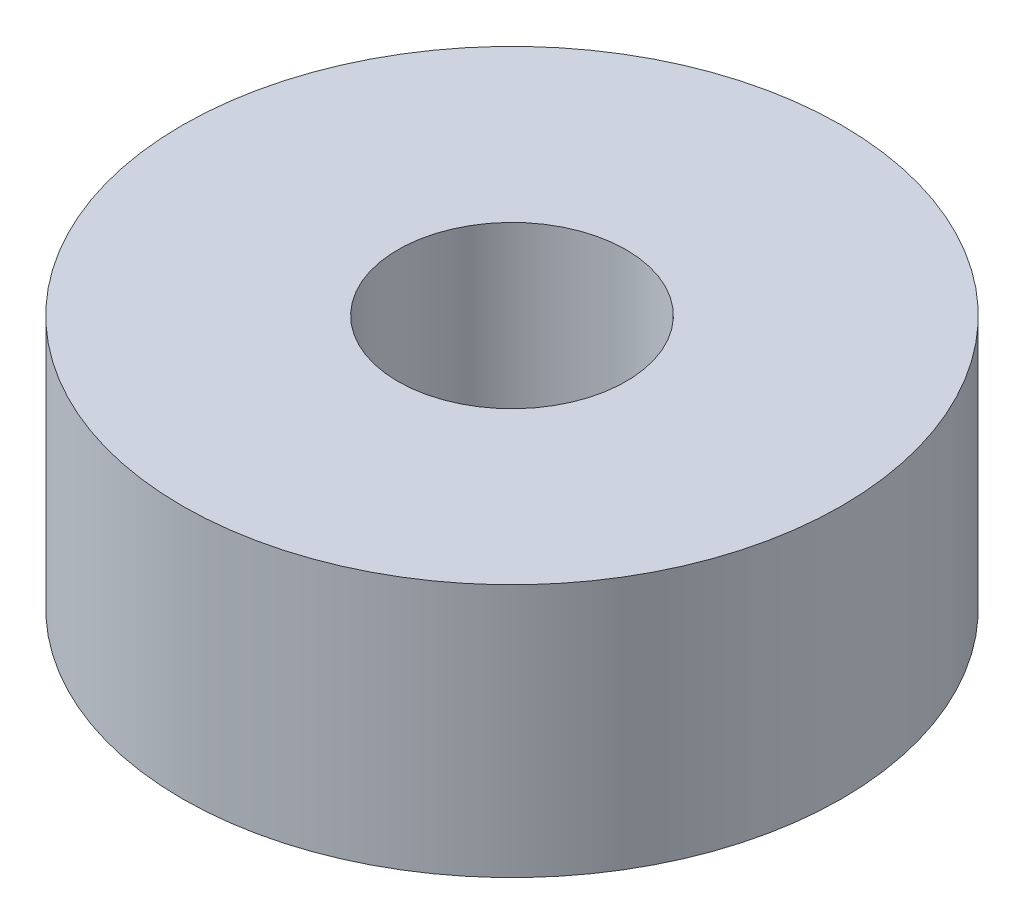
ISO-10303-21;
HEADER;
FILE_DESCRIPTION(('STEP AP214'),'2;1');
FILE_NAME('part.step','',(''),(''),'','','');
FILE_SCHEMA(('AUTOMOTIVE_DESIGN { 1 0 10303 214 1 1 1 1 }'));
ENDSEC;
DATA;
#1=APPLICATION_CONTEXT('core data for automotive mechanical design processes');
#2=APPLICATION_PROTOCOL_DEFINITION('international standard','automotive_design',2000,#1);
#3=PRODUCT_CONTEXT('',#1,'mechanical');
#4=PRODUCT('Part','Part','',(#3));
#5=PRODUCT_RELATED_PRODUCT_CATEGORY('part','',(#4));
#6=PRODUCT_DEFINITION_FORMATION('','',#4);
#7=PRODUCT_DEFINITION_CONTEXT('part definition',#1,'design');
#8=PRODUCT_DEFINITION('design','',#6,#7);
#9=PRODUCT_DEFINITION_SHAPE('','',#8);
#10=(LENGTH_UNIT() NAMED_UNIT(*) SI_UNIT(.MILLI.,.METRE.));
#11=(NAMED_UNIT(*) PLANE_ANGLE_UNIT() SI_UNIT($,.RADIAN.));
#12=(NAMED_UNIT(*) SI_UNIT($,.STERADIAN.) SOLID_ANGLE_UNIT());
#13=UNCERTAINTY_MEASURE_WITH_UNIT(LENGTH_MEASURE(1.E-05),#10,'distance_accuracy_value','');
#14=(GEOMETRIC_REPRESENTATION_CONTEXT(3) GLOBAL_UNCERTAINTY_ASSIGNED_CONTEXT((#13)) GLOBAL_UNIT_ASSIGNED_CONTEXT((#10,
#11,#12)) REPRESENTATION_CONTEXT('',''));
#15=CARTESIAN_POINT('',(0.,0.,0.));
#16=DIRECTION('',(0.,0.,1.));
#17=DIRECTION('',(1.,0.,0.));
#18=AXIS2_PLACEMENT_3D('',#15,#16,#17);
#19=CARTESIAN_POINT('',(0.,5.,0.));
#20=DIRECTION('',(0.,1.,0.));
#21=DIRECTION('',(0.,0.,1.));
#22=AXIS2_PLACEMENT_3D('',#19,#20,#21);
#23=PLANE('',#22);
#24=CARTESIAN_POINT('',(0.,5.,0.));
#25=DIRECTION('',(0.,1.,0.));
#26=DIRECTION('',(0.,0.,1.));
#27=AXIS2_PLACEMENT_3D('',#24,#25,#26);
#28=CIRCLE('',#27,6.5);
#29=CARTESIAN_POINT('',(0.,5.,6.5));
#30=VERTEX_POINT('',#29);
#31=EDGE_CURVE('E10',#30,#30,#28,.T.);
#32=ORIENTED_EDGE('',*,*,#31,.T.);
#33=EDGE_LOOP('',(#32));
#34=FACE_BOUND('',#33,.T.);
#35=CARTESIAN_POINT('',(0.,5.,0.));
#36=DIRECTION('',(0.,1.,0.));
#37=DIRECTION('',(0.,0.,1.));
#38=AXIS2_PLACEMENT_3D('',#35,#36,#37);
#39=CIRCLE('',#38,2.25);
#40=CARTESIAN_POINT('',(0.,5.,2.25));
#41=VERTEX_POINT('',#40);
#42=EDGE_CURVE('E50',#41,#41,#39,.T.);
#43=ORIENTED_EDGE('',*,*,#42,.F.);
#44=EDGE_LOOP('',(#43));
#45=FACE_BOUND('',#44,.T.);
#46=ADVANCED_FACE('F37',(#34,#45),#23,.T.);
#47=CARTESIAN_POINT('',(0.,0.,0.));
#48=DIRECTION('',(0.,1.,0.));
#49=DIRECTION('',(0.,0.,1.));
#50=AXIS2_PLACEMENT_3D('',#47,#48,#49);
#51=PLANE('',#50);
#52=CARTESIAN_POINT('',(0.,0.,0.));
#53=DIRECTION('',(0.,1.,0.));
#54=DIRECTION('',(0.,0.,1.));
#55=AXIS2_PLACEMENT_3D('',#52,#53,#54);
#56=CIRCLE('',#55,6.5);
#57=CARTESIAN_POINT('',(0.,0.,6.5));
#58=VERTEX_POINT('',#57);
#59=EDGE_CURVE('E41',#58,#58,#56,.T.);
#60=ORIENTED_EDGE('',*,*,#59,.F.);
#61=EDGE_LOOP('',(#60));
#62=FACE_BOUND('',#61,.T.);
#63=CARTESIAN_POINT('',(0.,0.,0.));
#64=DIRECTION('',(0.,1.,0.));
#65=DIRECTION('',(0.,0.,1.));
#66=AXIS2_PLACEMENT_3D('',#63,#64,#65);
#67=CIRCLE('',#66,2.25);
#68=CARTESIAN_POINT('',(0.,0.,2.25));
#69=VERTEX_POINT('',#68);
#70=EDGE_CURVE('E52',#69,#69,#67,.T.);
#71=ORIENTED_EDGE('',*,*,#70,.T.);
#72=EDGE_LOOP('',(#71));
#73=FACE_BOUND('',#72,.T.);
#74=ADVANCED_FACE('F64',(#62,#73),#51,.F.);
#75=CARTESIAN_POINT('',(0.,5.,0.));
#76=DIRECTION('',(0.,-1.,0.));
#77=DIRECTION('',(0.,0.,-1.));
#78=AXIS2_PLACEMENT_3D('',#75,#76,#77);
#79=CYLINDRICAL_SURFACE('',#78,6.5);
#80=ORIENTED_EDGE('',*,*,#31,.F.);
#81=EDGE_LOOP('',(#80));
#82=FACE_BOUND('',#81,.T.);
#83=ORIENTED_EDGE('',*,*,#59,.T.);
#84=EDGE_LOOP('',(#83));
#85=FACE_BOUND('',#84,.T.);
#86=ADVANCED_FACE('F39',(#82,#85),#79,.T.);
#87=CARTESIAN_POINT('',(0.,5.,0.));
#88=DIRECTION('',(0.,-1.,0.));
#89=DIRECTION('',(0.,0.,-1.));
#90=AXIS2_PLACEMENT_3D('',#87,#88,#89);
#91=CYLINDRICAL_SURFACE('',#90,2.25);
#92=ORIENTED_EDGE('',*,*,#42,.T.);
#93=EDGE_LOOP('',(#92));
#94=FACE_BOUND('',#93,.T.);
#95=ORIENTED_EDGE('',*,*,#70,.F.);
#96=EDGE_LOOP('',(#95));
#97=FACE_BOUND('',#96,.T.);
#98=ADVANCED_FACE('F60',(#94,#97),#91,.F.);
#99=CLOSED_SHELL('',(#46,#74,#86,#98));
#100=MANIFOLD_SOLID_BREP('B2',#99);
#101=ADVANCED_BREP_SHAPE_REPRESENTATION('',(#18,#100),#14);
#102=SHAPE_DEFINITION_REPRESENTATION(#9,#101);
ENDSEC;
END-ISO-10303-21;
